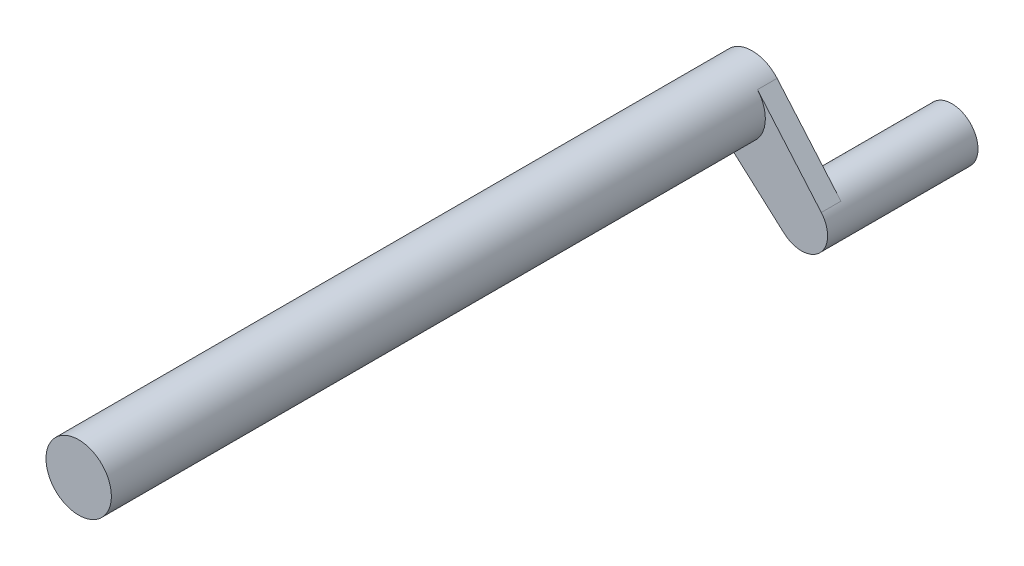
ISO-10303-21;
HEADER;
FILE_DESCRIPTION(('STEP AP214'),'2;1');
FILE_NAME('part.step','',(''),(''),'','','');
FILE_SCHEMA(('AUTOMOTIVE_DESIGN { 1 0 10303 214 1 1 1 1 }'));
ENDSEC;
DATA;
#1=APPLICATION_CONTEXT('core data for automotive mechanical design processes');
#2=APPLICATION_PROTOCOL_DEFINITION('international standard','automotive_design',2000,#1);
#3=PRODUCT_CONTEXT('',#1,'mechanical');
#4=PRODUCT('Part','Part','',(#3));
#5=PRODUCT_RELATED_PRODUCT_CATEGORY('part','',(#4));
#6=PRODUCT_DEFINITION_FORMATION('','',#4);
#7=PRODUCT_DEFINITION_CONTEXT('part definition',#1,'design');
#8=PRODUCT_DEFINITION('design','',#6,#7);
#9=PRODUCT_DEFINITION_SHAPE('','',#8);
#10=(LENGTH_UNIT() NAMED_UNIT(*) SI_UNIT(.MILLI.,.METRE.));
#11=(NAMED_UNIT(*) PLANE_ANGLE_UNIT() SI_UNIT($,.RADIAN.));
#12=(NAMED_UNIT(*) SI_UNIT($,.STERADIAN.) SOLID_ANGLE_UNIT());
#13=UNCERTAINTY_MEASURE_WITH_UNIT(LENGTH_MEASURE(1.E-05),#10,'distance_accuracy_value','');
#14=(GEOMETRIC_REPRESENTATION_CONTEXT(3) GLOBAL_UNCERTAINTY_ASSIGNED_CONTEXT((#13)) GLOBAL_UNIT_ASSIGNED_CONTEXT((#10,
#11,#12)) REPRESENTATION_CONTEXT('',''));
#15=CARTESIAN_POINT('',(0.,0.,0.));
#16=DIRECTION('',(0.,0.,1.));
#17=DIRECTION('',(1.,0.,0.));
#18=AXIS2_PLACEMENT_3D('',#15,#16,#17);
#19=CARTESIAN_POINT('',(0.,0.,200.));
#20=DIRECTION('',(0.,0.,-1.));
#21=DIRECTION('',(-1.,0.,0.));
#22=AXIS2_PLACEMENT_3D('',#19,#20,#21);
#23=CYLINDRICAL_SURFACE('',#22,10.);
#24=CARTESIAN_POINT('',(0.,0.,200.));
#25=DIRECTION('',(0.,0.,1.));
#26=DIRECTION('',(1.,0.,0.));
#27=AXIS2_PLACEMENT_3D('',#24,#25,#26);
#28=CIRCLE('',#27,10.);
#29=CARTESIAN_POINT('',(10.,0.,200.));
#30=VERTEX_POINT('',#29);
#31=EDGE_CURVE('E55',#30,#30,#28,.T.);
#32=ORIENTED_EDGE('',*,*,#31,.F.);
#33=EDGE_LOOP('',(#32));
#34=FACE_BOUND('',#33,.T.);
#35=CARTESIAN_POINT('',(0.,0.,0.));
#36=DIRECTION('',(0.,0.,1.));
#37=DIRECTION('',(1.,0.,0.));
#38=AXIS2_PLACEMENT_3D('',#35,#36,#37);
#39=CIRCLE('',#38,10.);
#40=CARTESIAN_POINT('',(-6.66092032257505,-7.45869562700521,0.));
#41=VERTEX_POINT('',#40);
#42=CARTESIAN_POINT('',(7.59206646489809,6.50849650784034,0.));
#43=VERTEX_POINT('',#42);
#44=EDGE_CURVE('E50',#41,#43,#39,.T.);
#45=ORIENTED_EDGE('',*,*,#44,.T.);
#46=DIRECTION('',(0.,0.,1.));
#47=VECTOR('',#46,1.);
#48=CARTESIAN_POINT('',(7.59206646489809,6.50849650784034,-6.));
#49=LINE('',#48,#47);
#50=CARTESIAN_POINT('',(7.59206646489809,6.50849650784034,-6.));
#51=VERTEX_POINT('',#50);
#52=EDGE_CURVE('E96',#51,#43,#49,.T.);
#53=ORIENTED_EDGE('',*,*,#52,.F.);
#54=CARTESIAN_POINT('',(0.,0.,-6.));
#55=DIRECTION('',(0.,0.,-1.));
#56=DIRECTION('',(-1.,0.,0.));
#57=AXIS2_PLACEMENT_3D('',#54,#55,#56);
#58=CIRCLE('',#57,10.);
#59=CARTESIAN_POINT('',(-6.66092032257505,-7.45869562700521,-6.));
#60=VERTEX_POINT('',#59);
#61=EDGE_CURVE('E72',#60,#51,#58,.T.);
#62=ORIENTED_EDGE('',*,*,#61,.F.);
#63=DIRECTION('',(0.,0.,1.));
#64=VECTOR('',#63,1.);
#65=CARTESIAN_POINT('',(-6.66092032257505,-7.45869562700521,-6.));
#66=LINE('',#65,#64);
#67=EDGE_CURVE('E108',#60,#41,#66,.T.);
#68=ORIENTED_EDGE('',*,*,#67,.T.);
#69=EDGE_LOOP('',(#45,#53,#62,#68));
#70=FACE_BOUND('',#69,.T.);
#71=ADVANCED_FACE('F47',(#34,#70),#23,.T.);
#72=CARTESIAN_POINT('',(0.,0.,200.));
#73=DIRECTION('',(0.,0.,1.));
#74=DIRECTION('',(1.,0.,0.));
#75=AXIS2_PLACEMENT_3D('',#72,#73,#74);
#76=PLANE('',#75);
#77=ORIENTED_EDGE('',*,*,#31,.T.);
#78=EDGE_LOOP('',(#77));
#79=FACE_BOUND('',#78,.T.);
#80=ADVANCED_FACE('F117',(#79),#76,.T.);
#81=CARTESIAN_POINT('',(21.0439028165006,-21.4745000931262,-6.));
#82=DIRECTION('',(0.,0.,1.));
#83=DIRECTION('',(1.,0.,0.));
#84=AXIS2_PLACEMENT_3D('',#81,#82,#83);
#85=CYLINDRICAL_SURFACE('',#84,8.);
#86=CARTESIAN_POINT('',(21.0439028165006,-21.4745000931262,0.));
#87=DIRECTION('',(0.,0.,-1.));
#88=DIRECTION('',(-1.,0.,0.));
#89=AXIS2_PLACEMENT_3D('',#86,#87,#88);
#90=CIRCLE('',#89,8.);
#91=CARTESIAN_POINT('',(27.1175559884191,-16.2677028868539,0.));
#92=VERTEX_POINT('',#91);
#93=CARTESIAN_POINT('',(15.7151665584406,-27.4414565947304,0.));
#94=VERTEX_POINT('',#93);
#95=EDGE_CURVE('E105',#92,#94,#90,.T.);
#96=ORIENTED_EDGE('',*,*,#95,.T.);
#97=DIRECTION('',(0.,0.,1.));
#98=VECTOR('',#97,1.);
#99=CARTESIAN_POINT('',(15.7151665584406,-27.4414565947304,-6.));
#100=LINE('',#99,#98);
#101=CARTESIAN_POINT('',(15.7151665584406,-27.4414565947304,-6.));
#102=VERTEX_POINT('',#101);
#103=EDGE_CURVE('E104',#102,#94,#100,.T.);
#104=ORIENTED_EDGE('',*,*,#103,.F.);
#105=CARTESIAN_POINT('',(21.0439028165006,-21.4745000931262,-6.));
#106=DIRECTION('',(0.,0.,-1.));
#107=DIRECTION('',(-1.,0.,0.));
#108=AXIS2_PLACEMENT_3D('',#105,#106,#107);
#109=CIRCLE('',#108,8.);
#110=CARTESIAN_POINT('',(27.1175559884191,-16.2677028868539,-6.));
#111=VERTEX_POINT('',#110);
#112=EDGE_CURVE('E11',#102,#111,#109,.T.);
#113=ORIENTED_EDGE('',*,*,#112,.T.);
#114=DIRECTION('',(0.,0.,1.));
#115=VECTOR('',#114,1.);
#116=CARTESIAN_POINT('',(27.1175559884191,-16.2677028868539,-6.));
#117=LINE('',#116,#115);
#118=EDGE_CURVE('E91',#111,#92,#117,.T.);
#119=ORIENTED_EDGE('',*,*,#118,.T.);
#120=EDGE_LOOP('',(#96,#104,#113,#119));
#121=FACE_BOUND('',#120,.T.);
#122=CARTESIAN_POINT('',(21.0439028165006,-21.4745000931262,-46.));
#123=DIRECTION('',(0.,0.,-1.));
#124=DIRECTION('',(-1.,0.,0.));
#125=AXIS2_PLACEMENT_3D('',#122,#123,#124);
#126=CIRCLE('',#125,8.);
#127=CARTESIAN_POINT('',(13.0439028165006,-21.4745000931262,-46.));
#128=VERTEX_POINT('',#127);
#129=EDGE_CURVE('E128',#128,#128,#126,.T.);
#130=ORIENTED_EDGE('',*,*,#129,.F.);
#131=EDGE_LOOP('',(#130));
#132=FACE_BOUND('',#131,.T.);
#133=ADVANCED_FACE('F101',(#121,#132),#85,.T.);
#134=CARTESIAN_POINT('',(15.7151665584406,-27.4414565947304,-6.));
#135=DIRECTION('',(0.666092032257505,0.745869562700521,0.));
#136=DIRECTION('',(-0.745869562700521,0.666092032257505,0.));
#137=AXIS2_PLACEMENT_3D('',#134,#135,#136);
#138=PLANE('',#137);
#139=DIRECTION('',(-0.745869562700521,0.666092032257505,0.));
#140=VECTOR('',#139,1.);
#141=CARTESIAN_POINT('',(15.7151665584406,-27.4414565947304,0.));
#142=LINE('',#141,#140);
#143=EDGE_CURVE('E123',#94,#41,#142,.T.);
#144=ORIENTED_EDGE('',*,*,#143,.T.);
#145=ORIENTED_EDGE('',*,*,#67,.F.);
#146=DIRECTION('',(-0.745869562700521,0.666092032257505,0.));
#147=VECTOR('',#146,1.);
#148=CARTESIAN_POINT('',(15.7151665584406,-27.4414565947304,-6.));
#149=LINE('',#148,#147);
#150=EDGE_CURVE('E126',#102,#60,#149,.T.);
#151=ORIENTED_EDGE('',*,*,#150,.F.);
#152=ORIENTED_EDGE('',*,*,#103,.T.);
#153=EDGE_LOOP('',(#144,#145,#151,#152));
#154=FACE_BOUND('',#153,.T.);
#155=ADVANCED_FACE('F124',(#154),#138,.F.);
#156=CARTESIAN_POINT('',(27.1175559884191,-16.2677028868539,-6.));
#157=DIRECTION('',(-0.759206646489809,-0.650849650784033,0.));
#158=DIRECTION('',(0.650849650784034,-0.759206646489809,0.));
#159=AXIS2_PLACEMENT_3D('',#156,#157,#158);
#160=PLANE('',#159);
#161=DIRECTION('',(0.650849650784034,-0.759206646489809,0.));
#162=VECTOR('',#161,1.);
#163=CARTESIAN_POINT('',(27.1175559884191,-16.2677028868539,0.));
#164=LINE('',#163,#162);
#165=EDGE_CURVE('E63',#43,#92,#164,.T.);
#166=ORIENTED_EDGE('',*,*,#165,.T.);
#167=ORIENTED_EDGE('',*,*,#118,.F.);
#168=DIRECTION('',(0.650849650784034,-0.759206646489809,0.));
#169=VECTOR('',#168,1.);
#170=CARTESIAN_POINT('',(27.1175559884191,-16.2677028868539,-6.));
#171=LINE('',#170,#169);
#172=EDGE_CURVE('E93',#51,#111,#171,.T.);
#173=ORIENTED_EDGE('',*,*,#172,.F.);
#174=ORIENTED_EDGE('',*,*,#52,.T.);
#175=EDGE_LOOP('',(#166,#167,#173,#174));
#176=FACE_BOUND('',#175,.T.);
#177=ADVANCED_FACE('F92',(#176),#160,.F.);
#178=CARTESIAN_POINT('',(21.0439028165006,-21.4745000931262,-6.));
#179=DIRECTION('',(0.,0.,-1.));
#180=DIRECTION('',(-1.,0.,0.));
#181=AXIS2_PLACEMENT_3D('',#178,#179,#180);
#182=PLANE('',#181);
#183=ORIENTED_EDGE('',*,*,#112,.F.);
#184=ORIENTED_EDGE('',*,*,#150,.T.);
#185=ORIENTED_EDGE('',*,*,#61,.T.);
#186=ORIENTED_EDGE('',*,*,#172,.T.);
#187=EDGE_LOOP('',(#183,#184,#185,#186));
#188=FACE_BOUND('',#187,.T.);
#189=ADVANCED_FACE('F98',(#188),#182,.T.);
#190=CARTESIAN_POINT('',(21.0439028165006,-21.4745000931262,0.));
#191=DIRECTION('',(0.,0.,-1.));
#192=DIRECTION('',(-1.,0.,0.));
#193=AXIS2_PLACEMENT_3D('',#190,#191,#192);
#194=PLANE('',#193);
#195=ORIENTED_EDGE('',*,*,#44,.F.);
#196=ORIENTED_EDGE('',*,*,#143,.F.);
#197=ORIENTED_EDGE('',*,*,#95,.F.);
#198=ORIENTED_EDGE('',*,*,#165,.F.);
#199=EDGE_LOOP('',(#195,#196,#197,#198));
#200=FACE_BOUND('',#199,.T.);
#201=ADVANCED_FACE('F122',(#200),#194,.F.);
#202=CARTESIAN_POINT('',(21.0439028165006,-21.4745000931262,-46.));
#203=DIRECTION('',(0.,0.,-1.));
#204=DIRECTION('',(-1.,0.,0.));
#205=AXIS2_PLACEMENT_3D('',#202,#203,#204);
#206=PLANE('',#205);
#207=ORIENTED_EDGE('',*,*,#129,.T.);
#208=EDGE_LOOP('',(#207));
#209=FACE_BOUND('',#208,.T.);
#210=ADVANCED_FACE('F136',(#209),#206,.T.);
#211=CLOSED_SHELL('',(#71,#80,#133,#155,#177,#189,#201,#210));
#212=MANIFOLD_SOLID_BREP('B2',#211);
#213=ADVANCED_BREP_SHAPE_REPRESENTATION('',(#18,#212),#14);
#214=SHAPE_DEFINITION_REPRESENTATION(#9,#213);
ENDSEC;
END-ISO-10303-21;
